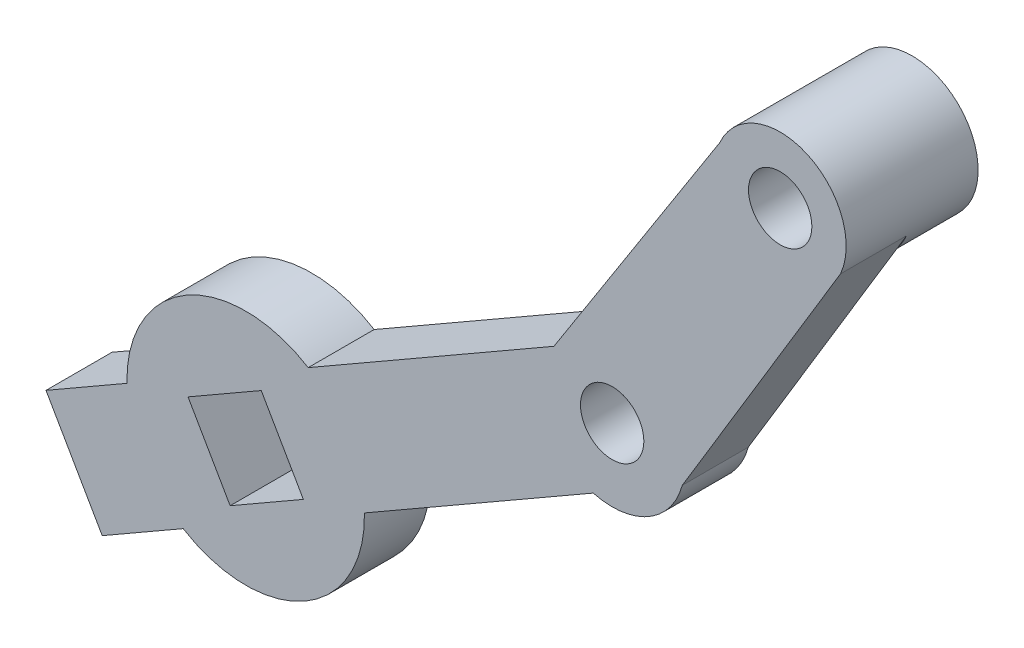
ISO-10303-21;
HEADER;
FILE_DESCRIPTION(('STEP AP214'),'2;1');
FILE_NAME('part.step','',(''),(''),'','','');
FILE_SCHEMA(('AUTOMOTIVE_DESIGN { 1 0 10303 214 1 1 1 1 }'));
ENDSEC;
DATA;
#1=APPLICATION_CONTEXT('core data for automotive mechanical design processes');
#2=APPLICATION_PROTOCOL_DEFINITION('international standard','automotive_design',2000,#1);
#3=PRODUCT_CONTEXT('',#1,'mechanical');
#4=PRODUCT('Part','Part','',(#3));
#5=PRODUCT_RELATED_PRODUCT_CATEGORY('part','',(#4));
#6=PRODUCT_DEFINITION_FORMATION('','',#4);
#7=PRODUCT_DEFINITION_CONTEXT('part definition',#1,'design');
#8=PRODUCT_DEFINITION('design','',#6,#7);
#9=PRODUCT_DEFINITION_SHAPE('','',#8);
#10=(LENGTH_UNIT() NAMED_UNIT(*) SI_UNIT(.MILLI.,.METRE.));
#11=(NAMED_UNIT(*) PLANE_ANGLE_UNIT() SI_UNIT($,.RADIAN.));
#12=(NAMED_UNIT(*) SI_UNIT($,.STERADIAN.) SOLID_ANGLE_UNIT());
#13=UNCERTAINTY_MEASURE_WITH_UNIT(LENGTH_MEASURE(1.E-05),#10,'distance_accuracy_value','');
#14=(GEOMETRIC_REPRESENTATION_CONTEXT(3) GLOBAL_UNCERTAINTY_ASSIGNED_CONTEXT((#13)) GLOBAL_UNIT_ASSIGNED_CONTEXT((#10,
#11,#12)) REPRESENTATION_CONTEXT('',''));
#15=CARTESIAN_POINT('',(0.,0.,0.));
#16=DIRECTION('',(0.,0.,1.));
#17=DIRECTION('',(1.,0.,0.));
#18=AXIS2_PLACEMENT_3D('',#15,#16,#17);
#19=CARTESIAN_POINT('',(0.17625658415401,-0.30648591573246,5.));
#20=DIRECTION('',(-0.498528903536302,0.866873077410351,0.));
#21=DIRECTION('',(-0.866873077410351,-0.498528903536302,0.));
#22=AXIS2_PLACEMENT_3D('',#19,#20,#21);
#23=PLANE('',#22);
#24=DIRECTION('',(0.,0.,-1.));
#25=VECTOR('',#24,1.);
#26=CARTESIAN_POINT('',(-20.556729316369,-12.2297916422161,30.4558441227157));
#27=LINE('',#26,#25);
#28=CARTESIAN_POINT('',(-20.556729316369,-12.2297916422161,5.));
#29=VERTEX_POINT('',#28);
#30=CARTESIAN_POINT('',(-20.556729316369,-12.2297916422161,0.));
#31=VERTEX_POINT('',#30);
#32=EDGE_CURVE('E153',#29,#31,#27,.T.);
#33=ORIENTED_EDGE('',*,*,#32,.F.);
#34=DIRECTION('',(0.866873077410351,0.498528903536302,0.));
#35=VECTOR('',#34,1.);
#36=CARTESIAN_POINT('',(0.17625658415401,-0.30648591573246,5.));
#37=LINE('',#36,#35);
#38=CARTESIAN_POINT('',(-1.93424021867878,-1.52020875988425,5.));
#39=VERTEX_POINT('',#38);
#40=EDGE_CURVE('E236',#29,#39,#37,.T.);
#41=ORIENTED_EDGE('',*,*,#40,.T.);
#42=DIRECTION('',(0.,0.,-1.));
#43=VECTOR('',#42,1.);
#44=CARTESIAN_POINT('',(-1.93424021867878,-1.52020875988425,5.));
#45=LINE('',#44,#43);
#46=CARTESIAN_POINT('',(-1.93424021867878,-1.52020875988425,0.));
#47=VERTEX_POINT('',#46);
#48=EDGE_CURVE('E39',#39,#47,#45,.T.);
#49=ORIENTED_EDGE('',*,*,#48,.T.);
#50=DIRECTION('',(0.866873077410351,0.498528903536302,0.));
#51=VECTOR('',#50,1.);
#52=CARTESIAN_POINT('',(0.17625658415401,-0.30648591573246,0.));
#53=LINE('',#52,#51);
#54=EDGE_CURVE('E149',#31,#47,#53,.T.);
#55=ORIENTED_EDGE('',*,*,#54,.F.);
#56=EDGE_LOOP('',(#33,#41,#49,#55));
#57=FACE_BOUND('',#56,.T.);
#58=ADVANCED_FACE('F35',(#57),#23,.T.);
#59=CARTESIAN_POINT('',(4.43647181358803,-7.71441323985198,5.));
#60=DIRECTION('',(-0.498528903536302,0.866873077410351,0.));
#61=DIRECTION('',(-0.866873077410351,-0.498528903536302,0.));
#62=AXIS2_PLACEMENT_3D('',#59,#60,#61);
#63=PLANE('',#62);
#64=DIRECTION('',(0.866873077410351,0.498528903536302,0.));
#65=VECTOR('',#64,1.);
#66=CARTESIAN_POINT('',(4.43647181358803,-7.71441323985198,5.));
#67=LINE('',#66,#65);
#68=CARTESIAN_POINT('',(-16.296514086935,-19.6377189663356,5.));
#69=VERTEX_POINT('',#68);
#70=CARTESIAN_POINT('',(1.04782478556533,-9.66318582418271,5.));
#71=VERTEX_POINT('',#70);
#72=EDGE_CURVE('E242',#69,#71,#67,.T.);
#73=ORIENTED_EDGE('',*,*,#72,.F.);
#74=DIRECTION('',(0.,0.,-1.));
#75=VECTOR('',#74,1.);
#76=CARTESIAN_POINT('',(-16.296514086935,-19.6377189663356,30.4558441227157));
#77=LINE('',#76,#75);
#78=CARTESIAN_POINT('',(-16.296514086935,-19.6377189663356,0.));
#79=VERTEX_POINT('',#78);
#80=EDGE_CURVE('E227',#69,#79,#77,.T.);
#81=ORIENTED_EDGE('',*,*,#80,.T.);
#82=DIRECTION('',(0.866873077410351,0.498528903536302,0.));
#83=VECTOR('',#82,1.);
#84=CARTESIAN_POINT('',(4.43647181358803,-7.71441323985198,0.));
#85=LINE('',#84,#83);
#86=CARTESIAN_POINT('',(1.04782478556533,-9.66318582418271,0.));
#87=VERTEX_POINT('',#86);
#88=EDGE_CURVE('E256',#79,#87,#85,.T.);
#89=ORIENTED_EDGE('',*,*,#88,.T.);
#90=DIRECTION('',(0.,0.,-1.));
#91=VECTOR('',#90,1.);
#92=CARTESIAN_POINT('',(1.04782478556533,-9.66318582418271,5.));
#93=LINE('',#92,#91);
#94=EDGE_CURVE('E268',#71,#87,#93,.T.);
#95=ORIENTED_EDGE('',*,*,#94,.F.);
#96=EDGE_LOOP('',(#73,#81,#89,#95));
#97=FACE_BOUND('',#96,.T.);
#98=ADVANCED_FACE('F305',(#97),#63,.F.);
#99=CARTESIAN_POINT('',(-0.682703439514869,0.436635830889686,5.));
#100=DIRECTION('',(-0.842436284988127,0.538795977838925,0.));
#101=DIRECTION('',(-0.538795977838925,-0.842436284988127,0.));
#102=AXIS2_PLACEMENT_3D('',#99,#100,#101);
#103=PLANE('',#102);
#104=DIRECTION('',(0.538795977838925,0.842436284988127,0.));
#105=VECTOR('',#104,1.);
#106=CARTESIAN_POINT('',(-0.682703439514869,0.436635830889686,0.));
#107=LINE('',#106,#105);
#108=CARTESIAN_POINT('',(10.6400793801503,18.1404114466345,0.));
#109=VERTEX_POINT('',#108);
#110=EDGE_CURVE('E144',#47,#109,#107,.T.);
#111=ORIENTED_EDGE('',*,*,#110,.F.);
#112=ORIENTED_EDGE('',*,*,#48,.F.);
#113=DIRECTION('',(0.538795977838925,0.842436284988127,0.));
#114=VECTOR('',#113,1.);
#115=CARTESIAN_POINT('',(-0.682703439514869,0.436635830889686,5.));
#116=LINE('',#115,#114);
#117=CARTESIAN_POINT('',(10.6400793801503,18.1404114466345,5.));
#118=VERTEX_POINT('',#117);
#119=EDGE_CURVE('E159',#39,#118,#116,.T.);
#120=ORIENTED_EDGE('',*,*,#119,.T.);
#121=DIRECTION('',(0.,0.,-1.));
#122=VECTOR('',#121,1.);
#123=CARTESIAN_POINT('',(10.6400793801503,18.1404114466345,5.));
#124=LINE('',#123,#122);
#125=EDGE_CURVE('E157',#118,#109,#124,.T.);
#126=ORIENTED_EDGE('',*,*,#125,.T.);
#127=EDGE_LOOP('',(#111,#112,#120,#126));
#128=FACE_BOUND('',#127,.T.);
#129=ADVANCED_FACE('F37',(#128),#103,.T.);
#130=DIRECTION('',(0.,0.,-1.));
#131=VECTOR('',#130,1.);
#132=CARTESIAN_POINT('',(-34.2898479293558,-20.1275528516411,30.4558441227157));
#133=LINE('',#132,#131);
#134=CARTESIAN_POINT('',(-34.2898479293558,-20.1275528516411,0.));
#135=VERTEX_POINT('',#134);
#136=CARTESIAN_POINT('',(-34.2898479293558,-20.1275528516411,5.));
#137=VERTEX_POINT('',#136);
#138=EDGE_CURVE('E230',#135,#137,#133,.F.);
#139=ORIENTED_EDGE('',*,*,#138,.F.);
#140=CARTESIAN_POINT('',(-40.4263847840177,-23.6566057999731,0.));
#141=VERTEX_POINT('',#140);
#142=EDGE_CURVE('E251',#141,#135,#53,.T.);
#143=ORIENTED_EDGE('',*,*,#142,.F.);
#144=DIRECTION('',(0.,0.,-1.));
#145=VECTOR('',#144,1.);
#146=CARTESIAN_POINT('',(-40.4263847840177,-23.6566057999731,5.));
#147=LINE('',#146,#145);
#148=CARTESIAN_POINT('',(-40.4263847840177,-23.6566057999731,5.));
#149=VERTEX_POINT('',#148);
#150=EDGE_CURVE('E273',#149,#141,#147,.T.);
#151=ORIENTED_EDGE('',*,*,#150,.F.);
#152=EDGE_CURVE('E238',#149,#137,#37,.T.);
#153=ORIENTED_EDGE('',*,*,#152,.T.);
#154=EDGE_LOOP('',(#139,#143,#151,#153));
#155=FACE_BOUND('',#154,.T.);
#156=ADVANCED_FACE('F306',(#155),#23,.T.);
#157=CARTESIAN_POINT('',(-40.6026413681717,-23.3501198842406,5.));
#158=DIRECTION('',(0.866873077410351,0.498528903536302,0.));
#159=DIRECTION('',(-0.498528903536302,0.866873077410351,0.));
#160=AXIS2_PLACEMENT_3D('',#157,#158,#159);
#161=PLANE('',#160);
#162=DIRECTION('',(0.498528903536302,-0.866873077410351,0.));
#163=VECTOR('',#162,1.);
#164=CARTESIAN_POINT('',(-40.6026413681717,-23.3501198842406,0.));
#165=LINE('',#164,#163);
#166=CARTESIAN_POINT('',(-36.1661695545836,-31.0645331240926,0.));
#167=VERTEX_POINT('',#166);
#168=EDGE_CURVE('E254',#141,#167,#165,.T.);
#169=ORIENTED_EDGE('',*,*,#168,.T.);
#170=DIRECTION('',(0.,0.,-1.));
#171=VECTOR('',#170,1.);
#172=CARTESIAN_POINT('',(-36.1661695545836,-31.0645331240926,5.));
#173=LINE('',#172,#171);
#174=CARTESIAN_POINT('',(-36.1661695545836,-31.0645331240926,5.));
#175=VERTEX_POINT('',#174);
#176=EDGE_CURVE('E271',#175,#167,#173,.T.);
#177=ORIENTED_EDGE('',*,*,#176,.F.);
#178=DIRECTION('',(0.498528903536302,-0.866873077410351,0.));
#179=VECTOR('',#178,1.);
#180=CARTESIAN_POINT('',(-40.6026413681717,-23.3501198842406,5.));
#181=LINE('',#180,#179);
#182=EDGE_CURVE('E240',#149,#175,#181,.T.);
#183=ORIENTED_EDGE('',*,*,#182,.F.);
#184=ORIENTED_EDGE('',*,*,#150,.T.);
#185=EDGE_LOOP('',(#169,#177,#183,#184));
#186=FACE_BOUND('',#185,.T.);
#187=ADVANCED_FACE('F315',(#186),#161,.F.);
#188=CARTESIAN_POINT('',(-30.0296326999218,-27.5354801757606,0.));
#189=VERTEX_POINT('',#188);
#190=EDGE_CURVE('E257',#167,#189,#85,.T.);
#191=ORIENTED_EDGE('',*,*,#190,.T.);
#192=DIRECTION('',(0.,0.,-1.));
#193=VECTOR('',#192,1.);
#194=CARTESIAN_POINT('',(-30.0296326999218,-27.5354801757606,30.4558441227157));
#195=LINE('',#194,#193);
#196=CARTESIAN_POINT('',(-30.0296326999218,-27.5354801757606,5.));
#197=VERTEX_POINT('',#196);
#198=EDGE_CURVE('E224',#189,#197,#195,.F.);
#199=ORIENTED_EDGE('',*,*,#198,.T.);
#200=EDGE_CURVE('E243',#175,#197,#67,.T.);
#201=ORIENTED_EDGE('',*,*,#200,.F.);
#202=ORIENTED_EDGE('',*,*,#176,.T.);
#203=EDGE_LOOP('',(#191,#199,#201,#202));
#204=FACE_BOUND('',#203,.T.);
#205=ADVANCED_FACE('F312',(#204),#63,.F.);
#206=CARTESIAN_POINT('',(2.48034743292827,-4.35301832543163,5.));
#207=DIRECTION('',(0.,0.,-1.));
#208=DIRECTION('',(-1.,0.,0.));
#209=AXIS2_PLACEMENT_3D('',#206,#207,#208);
#210=CYLINDRICAL_SURFACE('',#209,5.5);
#211=CARTESIAN_POINT('',(2.48034743292827,-4.35301832543163,0.));
#212=DIRECTION('',(0.,0.,1.));
#213=DIRECTION('',(1.,0.,0.));
#214=AXIS2_PLACEMENT_3D('',#211,#212,#213);
#215=CIRCLE('',#214,5.5);
#216=CARTESIAN_POINT('',(7.79051493167935,-5.78554097279456,0.));
#217=VERTEX_POINT('',#216);
#218=EDGE_CURVE('E260',#87,#217,#215,.T.);
#219=ORIENTED_EDGE('',*,*,#218,.T.);
#220=DIRECTION('',(0.,0.,-1.));
#221=VECTOR('',#220,1.);
#222=CARTESIAN_POINT('',(7.79051493167935,-5.78554097279456,5.));
#223=LINE('',#222,#221);
#224=CARTESIAN_POINT('',(7.79051493167935,-5.78554097279456,5.));
#225=VERTEX_POINT('',#224);
#226=EDGE_CURVE('E265',#225,#217,#223,.T.);
#227=ORIENTED_EDGE('',*,*,#226,.F.);
#228=CARTESIAN_POINT('',(2.48034743292827,-4.35301832543163,5.));
#229=DIRECTION('',(0.,0.,1.));
#230=DIRECTION('',(1.,0.,0.));
#231=AXIS2_PLACEMENT_3D('',#228,#229,#230);
#232=CIRCLE('',#231,5.5);
#233=EDGE_CURVE('E246',#71,#225,#232,.T.);
#234=ORIENTED_EDGE('',*,*,#233,.F.);
#235=ORIENTED_EDGE('',*,*,#94,.T.);
#236=EDGE_LOOP('',(#219,#227,#234,#235));
#237=FACE_BOUND('',#236,.T.);
#238=ADVANCED_FACE('F339',(#237),#210,.T.);
#239=CARTESIAN_POINT('',(8.27057905312399,-4.98984292672802,5.));
#240=DIRECTION('',(-0.856234541670631,0.51658727205583,0.));
#241=DIRECTION('',(-0.51658727205583,-0.856234541670632,0.));
#242=AXIS2_PLACEMENT_3D('',#239,#240,#241);
#243=PLANE('',#242);
#244=DIRECTION('',(0.51658727205583,0.856234541670631,0.));
#245=VECTOR('',#244,1.);
#246=CARTESIAN_POINT('',(8.27057905312399,-4.98984292672802,0.));
#247=LINE('',#246,#245);
#248=CARTESIAN_POINT('',(19.1338806378452,13.0158930961649,0.));
#249=VERTEX_POINT('',#248);
#250=EDGE_CURVE('E237',#217,#249,#247,.T.);
#251=ORIENTED_EDGE('',*,*,#250,.T.);
#252=CARTESIAN_POINT('',(19.7862245967424,14.097142017446,0.));
#253=VERTEX_POINT('',#252);
#254=EDGE_CURVE('E262',#249,#253,#247,.T.);
#255=ORIENTED_EDGE('',*,*,#254,.T.);
#256=DIRECTION('',(0.,0.,-1.));
#257=VECTOR('',#256,1.);
#258=CARTESIAN_POINT('',(19.7862245967424,14.097142017446,5.));
#259=LINE('',#258,#257);
#260=CARTESIAN_POINT('',(19.7862245967424,14.097142017446,5.));
#261=VERTEX_POINT('',#260);
#262=EDGE_CURVE('E162',#261,#253,#259,.T.);
#263=ORIENTED_EDGE('',*,*,#262,.F.);
#264=DIRECTION('',(0.51658727205583,0.856234541670631,0.));
#265=VECTOR('',#264,1.);
#266=CARTESIAN_POINT('',(8.27057905312399,-4.98984292672802,5.));
#267=LINE('',#266,#265);
#268=EDGE_CURVE('E248',#225,#261,#267,.T.);
#269=ORIENTED_EDGE('',*,*,#268,.F.);
#270=ORIENTED_EDGE('',*,*,#226,.T.);
#271=EDGE_LOOP('',(#251,#255,#263,#269,#270));
#272=FACE_BOUND('',#271,.T.);
#273=ADVANCED_FACE('F287',(#272),#243,.F.);
#274=CARTESIAN_POINT('',(15.2131519884464,16.1187767320402,5.));
#275=DIRECTION('',(0.,0.,-1.));
#276=DIRECTION('',(-1.,0.,0.));
#277=AXIS2_PLACEMENT_3D('',#274,#275,#276);
#278=CYLINDRICAL_SURFACE('',#277,5.);
#279=ORIENTED_EDGE('',*,*,#262,.T.);
#280=CARTESIAN_POINT('',(15.2131519884464,16.1187767320402,0.));
#281=DIRECTION('',(0.,0.,-1.));
#282=DIRECTION('',(-1.,0.,0.));
#283=AXIS2_PLACEMENT_3D('',#280,#281,#282);
#284=CIRCLE('',#283,5.);
#285=EDGE_CURVE('E45',#253,#249,#284,.T.);
#286=ORIENTED_EDGE('',*,*,#285,.T.);
#287=EDGE_CURVE('E11',#249,#109,#284,.T.);
#288=ORIENTED_EDGE('',*,*,#287,.T.);
#289=ORIENTED_EDGE('',*,*,#125,.F.);
#290=CARTESIAN_POINT('',(15.2131519884464,16.1187767320402,5.));
#291=DIRECTION('',(0.,0.,1.));
#292=DIRECTION('',(1.,0.,0.));
#293=AXIS2_PLACEMENT_3D('',#290,#291,#292);
#294=CIRCLE('',#293,5.);
#295=EDGE_CURVE('E163',#261,#118,#294,.T.);
#296=ORIENTED_EDGE('',*,*,#295,.F.);
#297=EDGE_LOOP('',(#279,#286,#288,#289,#296));
#298=FACE_BOUND('',#297,.T.);
#299=CARTESIAN_POINT('',(15.2131519884464,16.1187767320402,-5.));
#300=DIRECTION('',(0.,0.,-1.));
#301=DIRECTION('',(-1.,0.,0.));
#302=AXIS2_PLACEMENT_3D('',#299,#300,#301);
#303=CIRCLE('',#302,5.);
#304=CARTESIAN_POINT('',(10.2131519884464,16.1187767320402,-5.));
#305=VERTEX_POINT('',#304);
#306=EDGE_CURVE('E173',#305,#305,#303,.T.);
#307=ORIENTED_EDGE('',*,*,#306,.F.);
#308=EDGE_LOOP('',(#307));
#309=FACE_BOUND('',#308,.T.);
#310=ADVANCED_FACE('F167',(#298,#309),#278,.T.);
#311=CARTESIAN_POINT('',(0.,0.,5.));
#312=DIRECTION('',(0.,0.,1.));
#313=DIRECTION('',(1.,0.,0.));
#314=AXIS2_PLACEMENT_3D('',#311,#312,#313);
#315=PLANE('',#314);
#316=CARTESIAN_POINT('',(2.48034743292827,-4.35301832543163,5.));
#317=DIRECTION('',(0.,0.,1.));
#318=DIRECTION('',(1.,0.,0.));
#319=AXIS2_PLACEMENT_3D('',#316,#317,#318);
#320=CIRCLE('',#319,2.4);
#321=CARTESIAN_POINT('',(4.88034743292827,-4.35301832543163,5.));
#322=VERTEX_POINT('',#321);
#323=EDGE_CURVE('E442',#322,#322,#320,.F.);
#324=ORIENTED_EDGE('',*,*,#323,.T.);
#325=EDGE_LOOP('',(#324));
#326=FACE_BOUND('',#325,.T.);
#327=CARTESIAN_POINT('',(15.2131519884464,16.1187767320402,5.));
#328=DIRECTION('',(0.,0.,1.));
#329=DIRECTION('',(1.,0.,0.));
#330=AXIS2_PLACEMENT_3D('',#327,#328,#329);
#331=CIRCLE('',#330,2.4);
#332=CARTESIAN_POINT('',(17.6131519884464,16.1187767320402,5.));
#333=VERTEX_POINT('',#332);
#334=EDGE_CURVE('E179',#333,#333,#331,.F.);
#335=ORIENTED_EDGE('',*,*,#334,.T.);
#336=EDGE_LOOP('',(#335));
#337=FACE_BOUND('',#336,.T.);
#338=DIRECTION('',(-0.866873077410351,-0.498528903536302,0.));
#339=VECTOR('',#338,1.);
#340=CARTESIAN_POINT('',(-26.4718823645424,-24.2519222480176,5.));
#341=LINE('',#340,#339);
#342=CARTESIAN_POINT('',(-20.9238946691161,-21.0613372653853,5.));
#343=VERTEX_POINT('',#342);
#344=CARTESIAN_POINT('',(-26.4718823645424,-24.2519222480176,5.));
#345=VERTEX_POINT('',#344);
#346=EDGE_CURVE('E194',#343,#345,#341,.T.);
#347=ORIENTED_EDGE('',*,*,#346,.T.);
#348=DIRECTION('',(-0.498528903536302,0.866873077410351,0.));
#349=VECTOR('',#348,1.);
#350=CARTESIAN_POINT('',(-26.4718823645424,-24.2519222480176,5.));
#351=LINE('',#350,#349);
#352=CARTESIAN_POINT('',(-29.6624673471747,-18.7039345525914,5.));
#353=VERTEX_POINT('',#352);
#354=EDGE_CURVE('E210',#345,#353,#351,.T.);
#355=ORIENTED_EDGE('',*,*,#354,.T.);
#356=DIRECTION('',(0.866873077410351,0.498528903536302,0.));
#357=VECTOR('',#356,1.);
#358=CARTESIAN_POINT('',(-29.6624673471747,-18.7039345525914,5.));
#359=LINE('',#358,#357);
#360=CARTESIAN_POINT('',(-24.1144796517484,-15.513349569959,5.));
#361=VERTEX_POINT('',#360);
#362=EDGE_CURVE('E186',#353,#361,#359,.T.);
#363=ORIENTED_EDGE('',*,*,#362,.T.);
#364=DIRECTION('',(0.498528903536302,-0.866873077410351,0.));
#365=VECTOR('',#364,1.);
#366=CARTESIAN_POINT('',(-20.9238946691161,-21.0613372653853,5.));
#367=LINE('',#366,#365);
#368=EDGE_CURVE('E191',#361,#343,#367,.T.);
#369=ORIENTED_EDGE('',*,*,#368,.T.);
#370=EDGE_LOOP('',(#347,#355,#363,#369));
#371=FACE_BOUND('',#370,.T.);
#372=ORIENTED_EDGE('',*,*,#200,.T.);
#373=CARTESIAN_POINT('',(-25.2931810081454,-19.8826359089883,5.));
#374=DIRECTION('',(0.,0.,1.));
#375=DIRECTION('',(1.,0.,0.));
#376=AXIS2_PLACEMENT_3D('',#373,#374,#375);
#377=CIRCLE('',#376,9.);
#378=EDGE_CURVE('E221',#69,#197,#377,.F.);
#379=ORIENTED_EDGE('',*,*,#378,.F.);
#380=ORIENTED_EDGE('',*,*,#72,.T.);
#381=ORIENTED_EDGE('',*,*,#233,.T.);
#382=ORIENTED_EDGE('',*,*,#268,.T.);
#383=ORIENTED_EDGE('',*,*,#295,.T.);
#384=ORIENTED_EDGE('',*,*,#119,.F.);
#385=ORIENTED_EDGE('',*,*,#40,.F.);
#386=EDGE_CURVE('E223',#137,#29,#377,.F.);
#387=ORIENTED_EDGE('',*,*,#386,.F.);
#388=ORIENTED_EDGE('',*,*,#152,.F.);
#389=ORIENTED_EDGE('',*,*,#182,.T.);
#390=EDGE_LOOP('',(#372,#379,#380,#381,#382,#383,#384,#385,#387,#388,#389));
#391=FACE_BOUND('',#390,.T.);
#392=ADVANCED_FACE('F280',(#326,#337,#371,#391),#315,.T.);
#393=CARTESIAN_POINT('',(0.,0.,0.));
#394=DIRECTION('',(0.,0.,1.));
#395=DIRECTION('',(1.,0.,0.));
#396=AXIS2_PLACEMENT_3D('',#393,#394,#395);
#397=PLANE('',#396);
#398=CARTESIAN_POINT('',(2.48034743292827,-4.35301832543163,0.));
#399=DIRECTION('',(0.,0.,-1.));
#400=DIRECTION('',(-1.,0.,0.));
#401=AXIS2_PLACEMENT_3D('',#398,#399,#400);
#402=CIRCLE('',#401,2.4);
#403=CARTESIAN_POINT('',(0.0803474329282672,-4.35301832543163,0.));
#404=VERTEX_POINT('',#403);
#405=EDGE_CURVE('E445',#404,#404,#402,.T.);
#406=ORIENTED_EDGE('',*,*,#405,.F.);
#407=EDGE_LOOP('',(#406));
#408=FACE_BOUND('',#407,.T.);
#409=ORIENTED_EDGE('',*,*,#287,.F.);
#410=ORIENTED_EDGE('',*,*,#250,.F.);
#411=ORIENTED_EDGE('',*,*,#218,.F.);
#412=ORIENTED_EDGE('',*,*,#88,.F.);
#413=CARTESIAN_POINT('',(-25.2931810081454,-19.8826359089883,0.));
#414=DIRECTION('',(0.,0.,-1.));
#415=DIRECTION('',(-1.,0.,0.));
#416=AXIS2_PLACEMENT_3D('',#413,#414,#415);
#417=CIRCLE('',#416,9.);
#418=EDGE_CURVE('E220',#79,#189,#417,.T.);
#419=ORIENTED_EDGE('',*,*,#418,.T.);
#420=ORIENTED_EDGE('',*,*,#190,.F.);
#421=ORIENTED_EDGE('',*,*,#168,.F.);
#422=ORIENTED_EDGE('',*,*,#142,.T.);
#423=EDGE_CURVE('E218',#135,#31,#417,.T.);
#424=ORIENTED_EDGE('',*,*,#423,.T.);
#425=ORIENTED_EDGE('',*,*,#54,.T.);
#426=ORIENTED_EDGE('',*,*,#110,.T.);
#427=EDGE_LOOP('',(#409,#410,#411,#412,#419,#420,#421,#422,#424,#425,#426));
#428=FACE_BOUND('',#427,.T.);
#429=DIRECTION('',(-0.498528903536302,0.866873077410351,0.));
#430=VECTOR('',#429,1.);
#431=CARTESIAN_POINT('',(-26.4718823645424,-24.2519222480176,0.));
#432=LINE('',#431,#430);
#433=CARTESIAN_POINT('',(-26.4718823645424,-24.2519222480176,0.));
#434=VERTEX_POINT('',#433);
#435=CARTESIAN_POINT('',(-29.6624673471747,-18.7039345525914,0.));
#436=VERTEX_POINT('',#435);
#437=EDGE_CURVE('E199',#434,#436,#432,.T.);
#438=ORIENTED_EDGE('',*,*,#437,.F.);
#439=DIRECTION('',(-0.866873077410351,-0.498528903536301,0.));
#440=VECTOR('',#439,1.);
#441=CARTESIAN_POINT('',(-26.4718823645424,-24.2519222480176,0.));
#442=LINE('',#441,#440);
#443=CARTESIAN_POINT('',(-20.9238946691161,-21.0613372653853,0.));
#444=VERTEX_POINT('',#443);
#445=EDGE_CURVE('E197',#444,#434,#442,.T.);
#446=ORIENTED_EDGE('',*,*,#445,.F.);
#447=DIRECTION('',(0.498528903536302,-0.866873077410351,0.));
#448=VECTOR('',#447,1.);
#449=CARTESIAN_POINT('',(-20.9238946691161,-21.0613372653853,0.));
#450=LINE('',#449,#448);
#451=CARTESIAN_POINT('',(-24.1144796517484,-15.513349569959,0.));
#452=VERTEX_POINT('',#451);
#453=EDGE_CURVE('E204',#452,#444,#450,.T.);
#454=ORIENTED_EDGE('',*,*,#453,.F.);
#455=DIRECTION('',(0.866873077410351,0.498528903536302,0.));
#456=VECTOR('',#455,1.);
#457=CARTESIAN_POINT('',(-29.6624673471747,-18.7039345525914,0.));
#458=LINE('',#457,#456);
#459=EDGE_CURVE('E201',#436,#452,#458,.T.);
#460=ORIENTED_EDGE('',*,*,#459,.F.);
#461=EDGE_LOOP('',(#438,#446,#454,#460));
#462=FACE_BOUND('',#461,.T.);
#463=ADVANCED_FACE('F146',(#408,#428,#462),#397,.F.);
#464=CARTESIAN_POINT('',(-25.2931810081454,-19.8826359089883,30.4558441227157));
#465=DIRECTION('',(0.,0.,-1.));
#466=DIRECTION('',(-1.,0.,0.));
#467=AXIS2_PLACEMENT_3D('',#464,#465,#466);
#468=CYLINDRICAL_SURFACE('',#467,9.);
#469=ORIENTED_EDGE('',*,*,#80,.F.);
#470=ORIENTED_EDGE('',*,*,#378,.T.);
#471=ORIENTED_EDGE('',*,*,#198,.F.);
#472=ORIENTED_EDGE('',*,*,#418,.F.);
#473=EDGE_LOOP('',(#469,#470,#471,#472));
#474=FACE_BOUND('',#473,.T.);
#475=ADVANCED_FACE('F333',(#474),#468,.T.);
#476=ORIENTED_EDGE('',*,*,#386,.T.);
#477=ORIENTED_EDGE('',*,*,#32,.T.);
#478=ORIENTED_EDGE('',*,*,#423,.F.);
#479=ORIENTED_EDGE('',*,*,#138,.T.);
#480=EDGE_LOOP('',(#476,#477,#478,#479));
#481=FACE_BOUND('',#480,.T.);
#482=ADVANCED_FACE('F326',(#481),#468,.T.);
#483=CARTESIAN_POINT('',(-26.4718823645424,-24.2519222480176,5.001));
#484=DIRECTION('',(0.498528903536301,-0.866873077410351,0.));
#485=DIRECTION('',(0.866873077410351,0.498528903536302,0.));
#486=AXIS2_PLACEMENT_3D('',#483,#484,#485);
#487=PLANE('',#486);
#488=DIRECTION('',(0.,0.,-1.));
#489=VECTOR('',#488,1.);
#490=CARTESIAN_POINT('',(-20.9238946691161,-21.0613372653853,5.001));
#491=LINE('',#490,#489);
#492=EDGE_CURVE('E208',#343,#444,#491,.T.);
#493=ORIENTED_EDGE('',*,*,#492,.T.);
#494=ORIENTED_EDGE('',*,*,#445,.T.);
#495=DIRECTION('',(0.,0.,-1.));
#496=VECTOR('',#495,1.);
#497=CARTESIAN_POINT('',(-26.4718823645424,-24.2519222480176,5.001));
#498=LINE('',#497,#496);
#499=EDGE_CURVE('E207',#345,#434,#498,.T.);
#500=ORIENTED_EDGE('',*,*,#499,.F.);
#501=ORIENTED_EDGE('',*,*,#346,.F.);
#502=EDGE_LOOP('',(#493,#494,#500,#501));
#503=FACE_BOUND('',#502,.T.);
#504=ADVANCED_FACE('F358',(#503),#487,.F.);
#505=CARTESIAN_POINT('',(-20.9238946691161,-21.0613372653853,5.001));
#506=DIRECTION('',(0.866873077410351,0.498528903536302,0.));
#507=DIRECTION('',(-0.498528903536302,0.866873077410351,0.));
#508=AXIS2_PLACEMENT_3D('',#505,#506,#507);
#509=PLANE('',#508);
#510=CARTESIAN_POINT('',(-22.5191871604323,-18.2873434176722,2.5));
#511=DIRECTION('',(-0.866873077410351,-0.498528903536302,0.));
#512=DIRECTION('',(0.498528903536302,-0.866873077410351,0.));
#513=AXIS2_PLACEMENT_3D('',#510,#511,#512);
#514=CIRCLE('',#513,1.);
#515=CARTESIAN_POINT('',(-22.020658256896,-19.1542164950825,2.5));
#516=VERTEX_POINT('',#515);
#517=EDGE_CURVE('E176',#516,#516,#514,.T.);
#518=ORIENTED_EDGE('',*,*,#517,.F.);
#519=EDGE_LOOP('',(#518));
#520=FACE_BOUND('',#519,.T.);
#521=DIRECTION('',(0.,0.,-1.));
#522=VECTOR('',#521,1.);
#523=CARTESIAN_POINT('',(-24.1144796517484,-15.513349569959,5.001));
#524=LINE('',#523,#522);
#525=EDGE_CURVE('E211',#361,#452,#524,.T.);
#526=ORIENTED_EDGE('',*,*,#525,.T.);
#527=ORIENTED_EDGE('',*,*,#453,.T.);
#528=ORIENTED_EDGE('',*,*,#492,.F.);
#529=ORIENTED_EDGE('',*,*,#368,.F.);
#530=EDGE_LOOP('',(#526,#527,#528,#529));
#531=FACE_BOUND('',#530,.T.);
#532=ADVANCED_FACE('F361',(#520,#531),#509,.F.);
#533=CARTESIAN_POINT('',(-29.6624673471747,-18.7039345525914,5.001));
#534=DIRECTION('',(-0.498528903536302,0.866873077410351,0.));
#535=DIRECTION('',(-0.866873077410351,-0.498528903536302,0.));
#536=AXIS2_PLACEMENT_3D('',#533,#534,#535);
#537=PLANE('',#536);
#538=DIRECTION('',(0.,0.,-1.));
#539=VECTOR('',#538,1.);
#540=CARTESIAN_POINT('',(-29.6624673471747,-18.7039345525914,5.001));
#541=LINE('',#540,#539);
#542=EDGE_CURVE('E58',#353,#436,#541,.T.);
#543=ORIENTED_EDGE('',*,*,#542,.T.);
#544=ORIENTED_EDGE('',*,*,#459,.T.);
#545=ORIENTED_EDGE('',*,*,#525,.F.);
#546=ORIENTED_EDGE('',*,*,#362,.F.);
#547=EDGE_LOOP('',(#543,#544,#545,#546));
#548=FACE_BOUND('',#547,.T.);
#549=ADVANCED_FACE('F367',(#548),#537,.F.);
#550=CARTESIAN_POINT('',(-26.4718823645424,-24.2519222480176,5.001));
#551=DIRECTION('',(-0.866873077410351,-0.498528903536302,0.));
#552=DIRECTION('',(0.498528903536302,-0.866873077410351,0.));
#553=AXIS2_PLACEMENT_3D('',#550,#551,#552);
#554=PLANE('',#553);
#555=ORIENTED_EDGE('',*,*,#499,.T.);
#556=ORIENTED_EDGE('',*,*,#437,.T.);
#557=ORIENTED_EDGE('',*,*,#542,.F.);
#558=ORIENTED_EDGE('',*,*,#354,.F.);
#559=EDGE_LOOP('',(#555,#556,#557,#558));
#560=FACE_BOUND('',#559,.T.);
#561=ADVANCED_FACE('F363',(#560),#554,.F.);
#562=CARTESIAN_POINT('',(-22.0857506217271,-18.038078965904,2.5));
#563=DIRECTION('',(-0.866873077410351,-0.498528903536302,0.));
#564=DIRECTION('',(0.498528903536302,-0.866873077410351,0.));
#565=AXIS2_PLACEMENT_3D('',#562,#563,#564);
#566=CYLINDRICAL_SURFACE('',#565,1.);
#567=CARTESIAN_POINT('',(-22.0857506217271,-18.038078965904,2.5));
#568=DIRECTION('',(-0.866873077410351,-0.498528903536302,0.));
#569=DIRECTION('',(0.498528903536302,-0.866873077410351,0.));
#570=AXIS2_PLACEMENT_3D('',#567,#568,#569);
#571=CIRCLE('',#570,1.);
#572=CARTESIAN_POINT('',(-21.5872217181908,-18.9049520433144,2.5));
#573=VERTEX_POINT('',#572);
#574=EDGE_CURVE('E183',#573,#573,#571,.T.);
#575=ORIENTED_EDGE('',*,*,#574,.F.);
#576=EDGE_LOOP('',(#575));
#577=FACE_BOUND('',#576,.T.);
#578=ORIENTED_EDGE('',*,*,#517,.T.);
#579=EDGE_LOOP('',(#578));
#580=FACE_BOUND('',#579,.T.);
#581=ADVANCED_FACE('F366',(#577,#580),#566,.F.);
#582=CARTESIAN_POINT('',(-22.0857506217271,-18.038078965904,2.5));
#583=DIRECTION('',(-0.866873077410351,-0.498528903536302,0.));
#584=DIRECTION('',(0.498528903536302,-0.866873077410351,0.));
#585=AXIS2_PLACEMENT_3D('',#582,#583,#584);
#586=PLANE('',#585);
#587=ORIENTED_EDGE('',*,*,#574,.T.);
#588=EDGE_LOOP('',(#587));
#589=FACE_BOUND('',#588,.T.);
#590=ADVANCED_FACE('F300',(#589),#586,.T.);
#591=CARTESIAN_POINT('',(15.2131519884464,16.1187767320402,-5.));
#592=DIRECTION('',(0.,0.,-1.));
#593=DIRECTION('',(-1.,0.,0.));
#594=AXIS2_PLACEMENT_3D('',#591,#592,#593);
#595=PLANE('',#594);
#596=CARTESIAN_POINT('',(15.2131519884464,16.1187767320402,-5.));
#597=DIRECTION('',(0.,0.,-1.));
#598=DIRECTION('',(-1.,0.,0.));
#599=AXIS2_PLACEMENT_3D('',#596,#597,#598);
#600=CIRCLE('',#599,2.4);
#601=CARTESIAN_POINT('',(12.8131519884464,16.1187767320402,-5.));
#602=VERTEX_POINT('',#601);
#603=EDGE_CURVE('E174',#602,#602,#600,.T.);
#604=ORIENTED_EDGE('',*,*,#603,.F.);
#605=EDGE_LOOP('',(#604));
#606=FACE_BOUND('',#605,.T.);
#607=ORIENTED_EDGE('',*,*,#306,.T.);
#608=EDGE_LOOP('',(#607));
#609=FACE_BOUND('',#608,.T.);
#610=ADVANCED_FACE('F291',(#606,#609),#595,.T.);
#611=CARTESIAN_POINT('',(15.2131519884464,16.1187767320402,0.));
#612=DIRECTION('',(0.,0.,-1.));
#613=DIRECTION('',(-1.,0.,0.));
#614=AXIS2_PLACEMENT_3D('',#611,#612,#613);
#615=PLANE('',#614);
#616=ORIENTED_EDGE('',*,*,#254,.F.);
#617=ORIENTED_EDGE('',*,*,#285,.F.);
#618=EDGE_LOOP('',(#616,#617));
#619=FACE_BOUND('',#618,.T.);
#620=ADVANCED_FACE('F288',(#619),#615,.F.);
#621=CARTESIAN_POINT('',(15.2131519884464,16.1187767320402,5.001));
#622=DIRECTION('',(0.,0.,-1.));
#623=DIRECTION('',(-1.,0.,0.));
#624=AXIS2_PLACEMENT_3D('',#621,#622,#623);
#625=CYLINDRICAL_SURFACE('',#624,2.4);
#626=ORIENTED_EDGE('',*,*,#334,.F.);
#627=EDGE_LOOP('',(#626));
#628=FACE_BOUND('',#627,.T.);
#629=ORIENTED_EDGE('',*,*,#603,.T.);
#630=EDGE_LOOP('',(#629));
#631=FACE_BOUND('',#630,.T.);
#632=ADVANCED_FACE('F290',(#628,#631),#625,.F.);
#633=CARTESIAN_POINT('',(2.48034743292827,-4.35301832543163,5.001));
#634=DIRECTION('',(0.,0.,-1.));
#635=DIRECTION('',(-1.,0.,0.));
#636=AXIS2_PLACEMENT_3D('',#633,#634,#635);
#637=CYLINDRICAL_SURFACE('',#636,2.4);
#638=ORIENTED_EDGE('',*,*,#323,.F.);
#639=EDGE_LOOP('',(#638));
#640=FACE_BOUND('',#639,.T.);
#641=ORIENTED_EDGE('',*,*,#405,.T.);
#642=EDGE_LOOP('',(#641));
#643=FACE_BOUND('',#642,.T.);
#644=ADVANCED_FACE('F297',(#640,#643),#637,.F.);
#645=CLOSED_SHELL('',(#58,#98,#129,#156,#187,#205,#238,#273,#310,#392,#463,#475,#482,#504,#532,
#549,#561,#581,#590,#610,#620,#632,#644));
#646=MANIFOLD_SOLID_BREP('B2',#645);
#647=ADVANCED_BREP_SHAPE_REPRESENTATION('',(#18,#646),#14);
#648=SHAPE_DEFINITION_REPRESENTATION(#9,#647);
ENDSEC;
END-ISO-10303-21;
